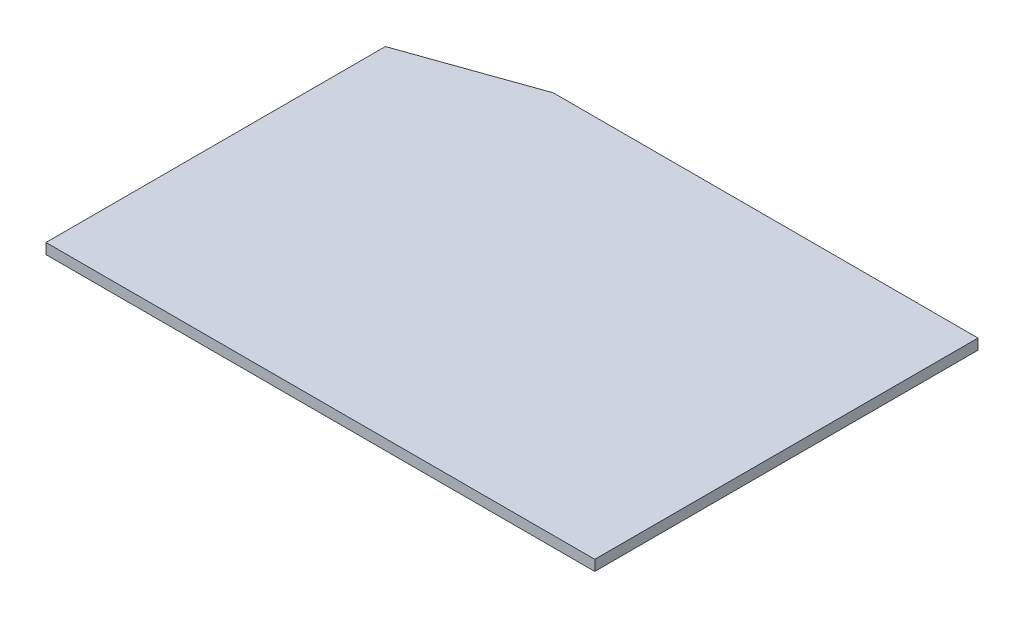
ISO-10303-21;
HEADER;
FILE_DESCRIPTION(('STEP AP214'),'2;1');
FILE_NAME('part.step','',(''),(''),'','','');
FILE_SCHEMA(('AUTOMOTIVE_DESIGN { 1 0 10303 214 1 1 1 1 }'));
ENDSEC;
DATA;
#1=APPLICATION_CONTEXT('core data for automotive mechanical design processes');
#2=APPLICATION_PROTOCOL_DEFINITION('international standard','automotive_design',2000,#1);
#3=PRODUCT_CONTEXT('',#1,'mechanical');
#4=PRODUCT('Part','Part','',(#3));
#5=PRODUCT_RELATED_PRODUCT_CATEGORY('part','',(#4));
#6=PRODUCT_DEFINITION_FORMATION('','',#4);
#7=PRODUCT_DEFINITION_CONTEXT('part definition',#1,'design');
#8=PRODUCT_DEFINITION('design','',#6,#7);
#9=PRODUCT_DEFINITION_SHAPE('','',#8);
#10=(LENGTH_UNIT() NAMED_UNIT(*) SI_UNIT(.MILLI.,.METRE.));
#11=(NAMED_UNIT(*) PLANE_ANGLE_UNIT() SI_UNIT($,.RADIAN.));
#12=(NAMED_UNIT(*) SI_UNIT($,.STERADIAN.) SOLID_ANGLE_UNIT());
#13=UNCERTAINTY_MEASURE_WITH_UNIT(LENGTH_MEASURE(1.E-05),#10,'distance_accuracy_value','');
#14=(GEOMETRIC_REPRESENTATION_CONTEXT(3) GLOBAL_UNCERTAINTY_ASSIGNED_CONTEXT((#13)) GLOBAL_UNIT_ASSIGNED_CONTEXT((#10,
#11,#12)) REPRESENTATION_CONTEXT('',''));
#15=CARTESIAN_POINT('',(0.,0.,0.));
#16=DIRECTION('',(0.,0.,1.));
#17=DIRECTION('',(1.,0.,0.));
#18=AXIS2_PLACEMENT_3D('',#15,#16,#17);
#19=CARTESIAN_POINT('',(0.,2.,-64.4065336293093));
#20=DIRECTION('',(1.,0.,0.));
#21=DIRECTION('',(0.,0.,-1.));
#22=AXIS2_PLACEMENT_3D('',#19,#20,#21);
#23=PLANE('',#22);
#24=DIRECTION('',(0.,0.,1.));
#25=VECTOR('',#24,1.);
#26=CARTESIAN_POINT('',(0.,0.,-64.4065336293093));
#27=LINE('',#26,#25);
#28=CARTESIAN_POINT('',(0.,0.,-64.4065336293093));
#29=VERTEX_POINT('',#28);
#30=CARTESIAN_POINT('',(0.,0.,0.));
#31=VERTEX_POINT('',#30);
#32=EDGE_CURVE('E118',#29,#31,#27,.T.);
#33=ORIENTED_EDGE('',*,*,#32,.T.);
#34=DIRECTION('',(0.,-1.,0.));
#35=VECTOR('',#34,1.);
#36=CARTESIAN_POINT('',(0.,2.,0.));
#37=LINE('',#36,#35);
#38=CARTESIAN_POINT('',(0.,2.,0.));
#39=VERTEX_POINT('',#38);
#40=EDGE_CURVE('E11',#39,#31,#37,.T.);
#41=ORIENTED_EDGE('',*,*,#40,.F.);
#42=DIRECTION('',(0.,0.,1.));
#43=VECTOR('',#42,1.);
#44=CARTESIAN_POINT('',(0.,2.,-64.4065336293093));
#45=LINE('',#44,#43);
#46=CARTESIAN_POINT('',(0.,2.,-64.4065336293093));
#47=VERTEX_POINT('',#46);
#48=EDGE_CURVE('E131',#47,#39,#45,.T.);
#49=ORIENTED_EDGE('',*,*,#48,.F.);
#50=DIRECTION('',(0.,-1.,0.));
#51=VECTOR('',#50,1.);
#52=CARTESIAN_POINT('',(0.,2.,-64.4065336293093));
#53=LINE('',#52,#51);
#54=EDGE_CURVE('E114',#47,#29,#53,.T.);
#55=ORIENTED_EDGE('',*,*,#54,.T.);
#56=EDGE_LOOP('',(#33,#41,#49,#55));
#57=FACE_BOUND('',#56,.T.);
#58=ADVANCED_FACE('F39',(#57),#23,.F.);
#59=CARTESIAN_POINT('',(0.,2.,0.));
#60=DIRECTION('',(0.,0.,-1.));
#61=DIRECTION('',(-1.,0.,0.));
#62=AXIS2_PLACEMENT_3D('',#59,#60,#61);
#63=PLANE('',#62);
#64=DIRECTION('',(1.,0.,0.));
#65=VECTOR('',#64,1.);
#66=CARTESIAN_POINT('',(0.,0.,0.));
#67=LINE('',#66,#65);
#68=CARTESIAN_POINT('',(104.149727965102,0.,0.));
#69=VERTEX_POINT('',#68);
#70=EDGE_CURVE('E122',#31,#69,#67,.T.);
#71=ORIENTED_EDGE('',*,*,#70,.T.);
#72=DIRECTION('',(0.,-1.,0.));
#73=VECTOR('',#72,1.);
#74=CARTESIAN_POINT('',(104.149727965102,2.,0.));
#75=LINE('',#74,#73);
#76=CARTESIAN_POINT('',(104.149727965102,2.,0.));
#77=VERTEX_POINT('',#76);
#78=EDGE_CURVE('E48',#77,#69,#75,.T.);
#79=ORIENTED_EDGE('',*,*,#78,.F.);
#80=DIRECTION('',(1.,0.,0.));
#81=VECTOR('',#80,1.);
#82=CARTESIAN_POINT('',(0.,2.,0.));
#83=LINE('',#82,#81);
#84=EDGE_CURVE('E90',#39,#77,#83,.T.);
#85=ORIENTED_EDGE('',*,*,#84,.F.);
#86=ORIENTED_EDGE('',*,*,#40,.T.);
#87=EDGE_LOOP('',(#71,#79,#85,#86));
#88=FACE_BOUND('',#87,.T.);
#89=ADVANCED_FACE('F153',(#88),#63,.F.);
#90=CARTESIAN_POINT('',(104.149727965102,2.,0.));
#91=DIRECTION('',(-1.,0.,0.));
#92=DIRECTION('',(0.,0.,1.));
#93=AXIS2_PLACEMENT_3D('',#90,#91,#92);
#94=PLANE('',#93);
#95=DIRECTION('',(0.,0.,-1.));
#96=VECTOR('',#95,1.);
#97=CARTESIAN_POINT('',(104.149727965102,0.,0.));
#98=LINE('',#97,#96);
#99=CARTESIAN_POINT('',(104.149727965102,0.,-72.7353240710093));
#100=VERTEX_POINT('',#99);
#101=EDGE_CURVE('E106',#69,#100,#98,.T.);
#102=ORIENTED_EDGE('',*,*,#101,.T.);
#103=DIRECTION('',(0.,-1.,0.));
#104=VECTOR('',#103,1.);
#105=CARTESIAN_POINT('',(104.149727965102,2.,-72.7353240710093));
#106=LINE('',#105,#104);
#107=CARTESIAN_POINT('',(104.149727965102,2.,-72.7353240710093));
#108=VERTEX_POINT('',#107);
#109=EDGE_CURVE('E103',#108,#100,#106,.T.);
#110=ORIENTED_EDGE('',*,*,#109,.F.);
#111=DIRECTION('',(0.,0.,-1.));
#112=VECTOR('',#111,1.);
#113=CARTESIAN_POINT('',(104.149727965102,2.,0.));
#114=LINE('',#113,#112);
#115=EDGE_CURVE('E94',#77,#108,#114,.T.);
#116=ORIENTED_EDGE('',*,*,#115,.F.);
#117=ORIENTED_EDGE('',*,*,#78,.T.);
#118=EDGE_LOOP('',(#102,#110,#116,#117));
#119=FACE_BOUND('',#118,.T.);
#120=ADVANCED_FACE('F104',(#119),#94,.F.);
#121=CARTESIAN_POINT('',(104.149727965102,2.,-72.7353240710093));
#122=DIRECTION('',(0.,0.,1.));
#123=DIRECTION('',(1.,0.,0.));
#124=AXIS2_PLACEMENT_3D('',#121,#122,#123);
#125=PLANE('',#124);
#126=DIRECTION('',(-1.,0.,0.));
#127=VECTOR('',#126,1.);
#128=CARTESIAN_POINT('',(104.149727965102,0.,-72.7353240710093));
#129=LINE('',#128,#127);
#130=CARTESIAN_POINT('',(23.5343354465922,0.,-72.7353240710093));
#131=VERTEX_POINT('',#130);
#132=EDGE_CURVE('E76',#100,#131,#129,.T.);
#133=ORIENTED_EDGE('',*,*,#132,.T.);
#134=DIRECTION('',(0.,-1.,0.));
#135=VECTOR('',#134,1.);
#136=CARTESIAN_POINT('',(23.5343354465922,2.,-72.7353240710093));
#137=LINE('',#136,#135);
#138=CARTESIAN_POINT('',(23.5343354465922,2.,-72.7353240710093));
#139=VERTEX_POINT('',#138);
#140=EDGE_CURVE('E108',#139,#131,#137,.T.);
#141=ORIENTED_EDGE('',*,*,#140,.F.);
#142=DIRECTION('',(-1.,0.,0.));
#143=VECTOR('',#142,1.);
#144=CARTESIAN_POINT('',(104.149727965102,2.,-72.7353240710093));
#145=LINE('',#144,#143);
#146=EDGE_CURVE('E98',#108,#139,#145,.T.);
#147=ORIENTED_EDGE('',*,*,#146,.F.);
#148=ORIENTED_EDGE('',*,*,#109,.T.);
#149=EDGE_LOOP('',(#133,#141,#147,#148));
#150=FACE_BOUND('',#149,.T.);
#151=ADVANCED_FACE('F110',(#150),#125,.F.);
#152=CARTESIAN_POINT('',(23.5343354465922,2.,-72.7353240710093));
#153=DIRECTION('',(0.333623375684593,0.,0.942706445929387));
#154=DIRECTION('',(0.942706445929387,0.,-0.333623375684593));
#155=AXIS2_PLACEMENT_3D('',#152,#153,#154);
#156=PLANE('',#155);
#157=DIRECTION('',(-0.942706445929387,0.,0.333623375684593));
#158=VECTOR('',#157,1.);
#159=CARTESIAN_POINT('',(23.5343354465922,0.,-72.7353240710093));
#160=LINE('',#159,#158);
#161=EDGE_CURVE('E82',#131,#29,#160,.T.);
#162=ORIENTED_EDGE('',*,*,#161,.T.);
#163=ORIENTED_EDGE('',*,*,#54,.F.);
#164=DIRECTION('',(-0.942706445929387,0.,0.333623375684593));
#165=VECTOR('',#164,1.);
#166=CARTESIAN_POINT('',(23.5343354465922,2.,-72.7353240710093));
#167=LINE('',#166,#165);
#168=EDGE_CURVE('E56',#139,#47,#167,.T.);
#169=ORIENTED_EDGE('',*,*,#168,.F.);
#170=ORIENTED_EDGE('',*,*,#140,.T.);
#171=EDGE_LOOP('',(#162,#163,#169,#170));
#172=FACE_BOUND('',#171,.T.);
#173=ADVANCED_FACE('F142',(#172),#156,.F.);
#174=CARTESIAN_POINT('',(0.,2.,0.));
#175=DIRECTION('',(0.,1.,0.));
#176=DIRECTION('',(0.,0.,1.));
#177=AXIS2_PLACEMENT_3D('',#174,#175,#176);
#178=PLANE('',#177);
#179=ORIENTED_EDGE('',*,*,#48,.T.);
#180=ORIENTED_EDGE('',*,*,#84,.T.);
#181=ORIENTED_EDGE('',*,*,#115,.T.);
#182=ORIENTED_EDGE('',*,*,#146,.T.);
#183=ORIENTED_EDGE('',*,*,#168,.T.);
#184=EDGE_LOOP('',(#179,#180,#181,#182,#183));
#185=FACE_BOUND('',#184,.T.);
#186=ADVANCED_FACE('F96',(#185),#178,.T.);
#187=CARTESIAN_POINT('',(0.,0.,0.));
#188=DIRECTION('',(0.,1.,0.));
#189=DIRECTION('',(0.,0.,1.));
#190=AXIS2_PLACEMENT_3D('',#187,#188,#189);
#191=PLANE('',#190);
#192=ORIENTED_EDGE('',*,*,#32,.F.);
#193=ORIENTED_EDGE('',*,*,#161,.F.);
#194=ORIENTED_EDGE('',*,*,#132,.F.);
#195=ORIENTED_EDGE('',*,*,#101,.F.);
#196=ORIENTED_EDGE('',*,*,#70,.F.);
#197=EDGE_LOOP('',(#192,#193,#194,#195,#196));
#198=FACE_BOUND('',#197,.T.);
#199=ADVANCED_FACE('F138',(#198),#191,.F.);
#200=CLOSED_SHELL('',(#58,#89,#120,#151,#173,#186,#199));
#201=MANIFOLD_SOLID_BREP('B2',#200);
#202=ADVANCED_BREP_SHAPE_REPRESENTATION('',(#18,#201),#14);
#203=SHAPE_DEFINITION_REPRESENTATION(#9,#202);
ENDSEC;
END-ISO-10303-21;
